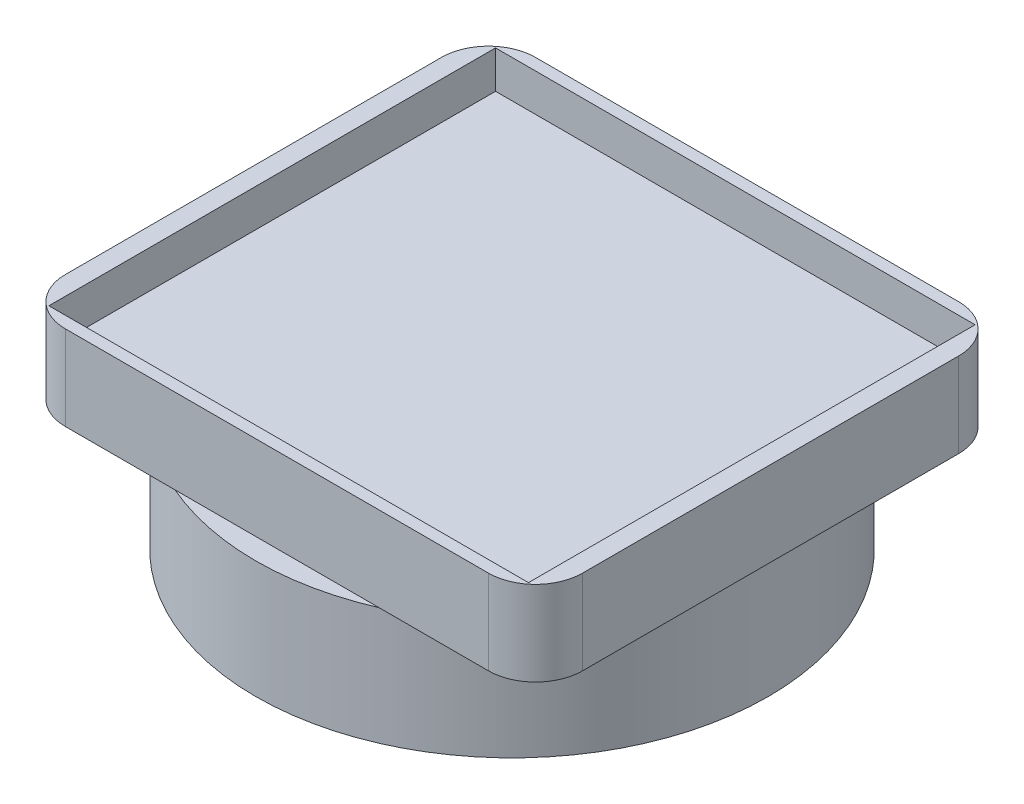
ISO-10303-21;
HEADER;
FILE_DESCRIPTION(('STEP AP214'),'2;1');
FILE_NAME('part.step','',(''),(''),'','','');
FILE_SCHEMA(('AUTOMOTIVE_DESIGN { 1 0 10303 214 1 1 1 1 }'));
ENDSEC;
DATA;
#1=APPLICATION_CONTEXT('core data for automotive mechanical design processes');
#2=APPLICATION_PROTOCOL_DEFINITION('international standard','automotive_design',2000,#1);
#3=PRODUCT_CONTEXT('',#1,'mechanical');
#4=PRODUCT('Part','Part','',(#3));
#5=PRODUCT_RELATED_PRODUCT_CATEGORY('part','',(#4));
#6=PRODUCT_DEFINITION_FORMATION('','',#4);
#7=PRODUCT_DEFINITION_CONTEXT('part definition',#1,'design');
#8=PRODUCT_DEFINITION('design','',#6,#7);
#9=PRODUCT_DEFINITION_SHAPE('','',#8);
#10=(LENGTH_UNIT() NAMED_UNIT(*) SI_UNIT(.MILLI.,.METRE.));
#11=(NAMED_UNIT(*) PLANE_ANGLE_UNIT() SI_UNIT($,.RADIAN.));
#12=(NAMED_UNIT(*) SI_UNIT($,.STERADIAN.) SOLID_ANGLE_UNIT());
#13=UNCERTAINTY_MEASURE_WITH_UNIT(LENGTH_MEASURE(1.E-05),#10,'distance_accuracy_value','');
#14=(GEOMETRIC_REPRESENTATION_CONTEXT(3) GLOBAL_UNCERTAINTY_ASSIGNED_CONTEXT((#13)) GLOBAL_UNIT_ASSIGNED_CONTEXT((#10,
#11,#12)) REPRESENTATION_CONTEXT('',''));
#15=CARTESIAN_POINT('',(0.,0.,0.));
#16=DIRECTION('',(0.,0.,1.));
#17=DIRECTION('',(1.,0.,0.));
#18=AXIS2_PLACEMENT_3D('',#15,#16,#17);
#19=CARTESIAN_POINT('',(0.,-2.54,0.));
#20=DIRECTION('',(0.,-1.,0.));
#21=DIRECTION('',(0.,0.,-1.));
#22=AXIS2_PLACEMENT_3D('',#19,#20,#21);
#23=PLANE('',#22);
#24=DIRECTION('',(0.,0.,-1.));
#25=VECTOR('',#24,1.);
#26=CARTESIAN_POINT('',(13.97,-2.54,-12.7));
#27=LINE('',#26,#25);
#28=CARTESIAN_POINT('',(13.97,-2.54,10.16));
#29=VERTEX_POINT('',#28);
#30=CARTESIAN_POINT('',(13.97,-2.54,-10.16));
#31=VERTEX_POINT('',#30);
#32=EDGE_CURVE('E163',#29,#31,#27,.T.);
#33=ORIENTED_EDGE('',*,*,#32,.F.);
#34=CARTESIAN_POINT('',(11.43,-2.54,10.16));
#35=DIRECTION('',(0.,-1.,0.));
#36=DIRECTION('',(0.,0.,-1.));
#37=AXIS2_PLACEMENT_3D('',#34,#35,#36);
#38=CIRCLE('',#37,2.54);
#39=CARTESIAN_POINT('',(11.43,-2.54,12.7));
#40=VERTEX_POINT('',#39);
#41=EDGE_CURVE('E11',#29,#40,#38,.T.);
#42=ORIENTED_EDGE('',*,*,#41,.T.);
#43=DIRECTION('',(1.,0.,0.));
#44=VECTOR('',#43,1.);
#45=CARTESIAN_POINT('',(13.97,-2.54,12.7));
#46=LINE('',#45,#44);
#47=CARTESIAN_POINT('',(5.50805310431917,-2.54,12.7));
#48=VERTEX_POINT('',#47);
#49=EDGE_CURVE('E196',#48,#40,#46,.T.);
#50=ORIENTED_EDGE('',*,*,#49,.F.);
#51=CARTESIAN_POINT('',(0.,-2.54,0.));
#52=DIRECTION('',(0.,-1.,0.));
#53=DIRECTION('',(0.,0.,-1.));
#54=AXIS2_PLACEMENT_3D('',#51,#52,#53);
#55=CIRCLE('',#54,13.843);
#56=CARTESIAN_POINT('',(5.50805310431917,-2.54,-12.7));
#57=VERTEX_POINT('',#56);
#58=EDGE_CURVE('E171',#57,#48,#55,.T.);
#59=ORIENTED_EDGE('',*,*,#58,.F.);
#60=DIRECTION('',(-1.,0.,0.));
#61=VECTOR('',#60,1.);
#62=CARTESIAN_POINT('',(13.97,-2.54,-12.7));
#63=LINE('',#62,#61);
#64=CARTESIAN_POINT('',(11.43,-2.54,-12.7));
#65=VERTEX_POINT('',#64);
#66=EDGE_CURVE('E146',#65,#57,#63,.T.);
#67=ORIENTED_EDGE('',*,*,#66,.F.);
#68=CARTESIAN_POINT('',(11.43,-2.54,-10.16));
#69=DIRECTION('',(0.,-1.,0.));
#70=DIRECTION('',(0.,0.,-1.));
#71=AXIS2_PLACEMENT_3D('',#68,#69,#70);
#72=CIRCLE('',#71,2.54);
#73=EDGE_CURVE('E48',#65,#31,#72,.T.);
#74=ORIENTED_EDGE('',*,*,#73,.T.);
#75=EDGE_LOOP('',(#33,#42,#50,#59,#67,#74));
#76=FACE_BOUND('',#75,.T.);
#77=ADVANCED_FACE('F39',(#76),#23,.T.);
#78=CARTESIAN_POINT('',(0.,2.032,0.));
#79=DIRECTION('',(0.,1.,0.));
#80=DIRECTION('',(0.,0.,1.));
#81=AXIS2_PLACEMENT_3D('',#78,#79,#80);
#82=PLANE('',#81);
#83=DIRECTION('',(-1.,0.,0.));
#84=VECTOR('',#83,1.);
#85=CARTESIAN_POINT('',(-13.97,2.032,-12.7));
#86=LINE('',#85,#84);
#87=CARTESIAN_POINT('',(11.43,2.032,-12.7));
#88=VERTEX_POINT('',#87);
#89=CARTESIAN_POINT('',(-11.43,2.032,-12.7));
#90=VERTEX_POINT('',#89);
#91=EDGE_CURVE('E253',#88,#90,#86,.T.);
#92=ORIENTED_EDGE('',*,*,#91,.T.);
#93=CARTESIAN_POINT('',(-11.43,2.032,-10.16));
#94=DIRECTION('',(0.,1.,0.));
#95=DIRECTION('',(0.,0.,1.));
#96=AXIS2_PLACEMENT_3D('',#93,#94,#95);
#97=CIRCLE('',#96,2.54);
#98=CARTESIAN_POINT('',(-13.97,2.032,-10.16));
#99=VERTEX_POINT('',#98);
#100=EDGE_CURVE('E287',#90,#99,#97,.T.);
#101=ORIENTED_EDGE('',*,*,#100,.T.);
#102=DIRECTION('',(0.,0.,1.));
#103=VECTOR('',#102,1.);
#104=CARTESIAN_POINT('',(-13.97,2.032,-12.7));
#105=LINE('',#104,#103);
#106=CARTESIAN_POINT('',(-13.97,2.032,10.16));
#107=VERTEX_POINT('',#106);
#108=EDGE_CURVE('E183',#99,#107,#105,.T.);
#109=ORIENTED_EDGE('',*,*,#108,.T.);
#110=CARTESIAN_POINT('',(-11.43,2.032,10.16));
#111=DIRECTION('',(0.,1.,0.));
#112=DIRECTION('',(0.,0.,1.));
#113=AXIS2_PLACEMENT_3D('',#110,#111,#112);
#114=CIRCLE('',#113,2.54);
#115=CARTESIAN_POINT('',(-11.43,2.032,12.7));
#116=VERTEX_POINT('',#115);
#117=EDGE_CURVE('E284',#107,#116,#114,.T.);
#118=ORIENTED_EDGE('',*,*,#117,.T.);
#119=DIRECTION('',(1.,0.,0.));
#120=VECTOR('',#119,1.);
#121=CARTESIAN_POINT('',(-13.97,2.032,12.7));
#122=LINE('',#121,#120);
#123=CARTESIAN_POINT('',(11.43,2.032,12.7));
#124=VERTEX_POINT('',#123);
#125=EDGE_CURVE('E177',#116,#124,#122,.T.);
#126=ORIENTED_EDGE('',*,*,#125,.T.);
#127=CARTESIAN_POINT('',(11.43,2.032,10.16));
#128=DIRECTION('',(0.,1.,0.));
#129=DIRECTION('',(0.,0.,1.));
#130=AXIS2_PLACEMENT_3D('',#127,#128,#129);
#131=CIRCLE('',#130,2.54);
#132=CARTESIAN_POINT('',(13.97,2.032,10.16));
#133=VERTEX_POINT('',#132);
#134=EDGE_CURVE('E281',#124,#133,#131,.T.);
#135=ORIENTED_EDGE('',*,*,#134,.T.);
#136=DIRECTION('',(0.,0.,-1.));
#137=VECTOR('',#136,1.);
#138=CARTESIAN_POINT('',(13.97,2.032,-12.7));
#139=LINE('',#138,#137);
#140=CARTESIAN_POINT('',(13.97,2.032,-10.16));
#141=VERTEX_POINT('',#140);
#142=EDGE_CURVE('E249',#133,#141,#139,.T.);
#143=ORIENTED_EDGE('',*,*,#142,.T.);
#144=CARTESIAN_POINT('',(11.43,2.032,-10.16));
#145=DIRECTION('',(0.,1.,0.));
#146=DIRECTION('',(0.,0.,1.));
#147=AXIS2_PLACEMENT_3D('',#144,#145,#146);
#148=CIRCLE('',#147,2.54);
#149=EDGE_CURVE('E278',#141,#88,#148,.T.);
#150=ORIENTED_EDGE('',*,*,#149,.T.);
#151=EDGE_LOOP('',(#92,#101,#109,#118,#126,#135,#143,#150));
#152=FACE_BOUND('',#151,.T.);
#153=DIRECTION('',(-1.,0.,0.));
#154=VECTOR('',#153,1.);
#155=CARTESIAN_POINT('',(-12.954,2.032,-12.065));
#156=LINE('',#155,#154);
#157=CARTESIAN_POINT('',(12.954,2.032,-12.065));
#158=VERTEX_POINT('',#157);
#159=CARTESIAN_POINT('',(-12.954,2.032,-12.065));
#160=VERTEX_POINT('',#159);
#161=EDGE_CURVE('E226',#158,#160,#156,.T.);
#162=ORIENTED_EDGE('',*,*,#161,.F.);
#163=DIRECTION('',(0.,0.,-1.));
#164=VECTOR('',#163,1.);
#165=CARTESIAN_POINT('',(12.954,2.032,-12.065));
#166=LINE('',#165,#164);
#167=CARTESIAN_POINT('',(12.954,2.032,12.065));
#168=VERTEX_POINT('',#167);
#169=EDGE_CURVE('E223',#168,#158,#166,.T.);
#170=ORIENTED_EDGE('',*,*,#169,.F.);
#171=DIRECTION('',(1.,0.,0.));
#172=VECTOR('',#171,1.);
#173=CARTESIAN_POINT('',(-12.954,2.032,12.065));
#174=LINE('',#173,#172);
#175=CARTESIAN_POINT('',(-12.954,2.032,12.065));
#176=VERTEX_POINT('',#175);
#177=EDGE_CURVE('E233',#176,#168,#174,.T.);
#178=ORIENTED_EDGE('',*,*,#177,.F.);
#179=DIRECTION('',(0.,0.,1.));
#180=VECTOR('',#179,1.);
#181=CARTESIAN_POINT('',(-12.954,2.032,-12.065));
#182=LINE('',#181,#180);
#183=EDGE_CURVE('E229',#160,#176,#182,.T.);
#184=ORIENTED_EDGE('',*,*,#183,.F.);
#185=EDGE_LOOP('',(#162,#170,#178,#184));
#186=FACE_BOUND('',#185,.T.);
#187=ADVANCED_FACE('F312',(#152,#186),#82,.T.);
#188=CARTESIAN_POINT('',(13.97,2.032,-12.7));
#189=DIRECTION('',(-1.,0.,0.));
#190=DIRECTION('',(0.,0.,1.));
#191=AXIS2_PLACEMENT_3D('',#188,#189,#190);
#192=PLANE('',#191);
#193=ORIENTED_EDGE('',*,*,#142,.F.);
#194=DIRECTION('',(0.,-1.,0.));
#195=VECTOR('',#194,1.);
#196=CARTESIAN_POINT('',(13.97,2.032,10.16));
#197=LINE('',#196,#195);
#198=EDGE_CURVE('E300',#133,#29,#197,.T.);
#199=ORIENTED_EDGE('',*,*,#198,.T.);
#200=ORIENTED_EDGE('',*,*,#32,.T.);
#201=DIRECTION('',(0.,-1.,0.));
#202=VECTOR('',#201,1.);
#203=CARTESIAN_POINT('',(13.97,2.032,-10.16));
#204=LINE('',#203,#202);
#205=EDGE_CURVE('E297',#31,#141,#204,.F.);
#206=ORIENTED_EDGE('',*,*,#205,.T.);
#207=EDGE_LOOP('',(#193,#199,#200,#206));
#208=FACE_BOUND('',#207,.T.);
#209=ADVANCED_FACE('F305',(#208),#192,.F.);
#210=CARTESIAN_POINT('',(-13.97,2.032,-12.7));
#211=DIRECTION('',(0.,0.,1.));
#212=DIRECTION('',(1.,0.,0.));
#213=AXIS2_PLACEMENT_3D('',#210,#211,#212);
#214=PLANE('',#213);
#215=CARTESIAN_POINT('',(-5.50805310431917,-2.54,-12.7));
#216=VERTEX_POINT('',#215);
#217=CARTESIAN_POINT('',(-11.43,-2.54,-12.7));
#218=VERTEX_POINT('',#217);
#219=EDGE_CURVE('E143',#216,#218,#63,.T.);
#220=ORIENTED_EDGE('',*,*,#219,.T.);
#221=DIRECTION('',(0.,-1.,0.));
#222=VECTOR('',#221,1.);
#223=CARTESIAN_POINT('',(-11.43,2.032,-12.7));
#224=LINE('',#223,#222);
#225=EDGE_CURVE('E275',#218,#90,#224,.F.);
#226=ORIENTED_EDGE('',*,*,#225,.T.);
#227=ORIENTED_EDGE('',*,*,#91,.F.);
#228=DIRECTION('',(0.,-1.,0.));
#229=VECTOR('',#228,1.);
#230=CARTESIAN_POINT('',(11.43,2.032,-12.7));
#231=LINE('',#230,#229);
#232=EDGE_CURVE('E272',#88,#65,#231,.T.);
#233=ORIENTED_EDGE('',*,*,#232,.T.);
#234=ORIENTED_EDGE('',*,*,#66,.T.);
#235=EDGE_CURVE('E140',#57,#216,#63,.T.);
#236=ORIENTED_EDGE('',*,*,#235,.T.);
#237=EDGE_LOOP('',(#220,#226,#227,#233,#234,#236));
#238=FACE_BOUND('',#237,.T.);
#239=ADVANCED_FACE('F142',(#238),#214,.F.);
#240=CARTESIAN_POINT('',(-13.97,2.032,-12.7));
#241=DIRECTION('',(1.,0.,0.));
#242=DIRECTION('',(0.,0.,-1.));
#243=AXIS2_PLACEMENT_3D('',#240,#241,#242);
#244=PLANE('',#243);
#245=ORIENTED_EDGE('',*,*,#108,.F.);
#246=DIRECTION('',(0.,-1.,0.));
#247=VECTOR('',#246,1.);
#248=CARTESIAN_POINT('',(-13.97,2.032,-10.16));
#249=LINE('',#248,#247);
#250=CARTESIAN_POINT('',(-13.97,-2.54,-10.16));
#251=VERTEX_POINT('',#250);
#252=EDGE_CURVE('E180',#99,#251,#249,.T.);
#253=ORIENTED_EDGE('',*,*,#252,.T.);
#254=DIRECTION('',(0.,0.,1.));
#255=VECTOR('',#254,1.);
#256=CARTESIAN_POINT('',(-13.97,-2.54,-12.7));
#257=LINE('',#256,#255);
#258=CARTESIAN_POINT('',(-13.97,-2.54,10.16));
#259=VERTEX_POINT('',#258);
#260=EDGE_CURVE('E193',#251,#259,#257,.T.);
#261=ORIENTED_EDGE('',*,*,#260,.T.);
#262=DIRECTION('',(0.,-1.,0.));
#263=VECTOR('',#262,1.);
#264=CARTESIAN_POINT('',(-13.97,2.032,10.16));
#265=LINE('',#264,#263);
#266=EDGE_CURVE('E176',#259,#107,#265,.F.);
#267=ORIENTED_EDGE('',*,*,#266,.T.);
#268=EDGE_LOOP('',(#245,#253,#261,#267));
#269=FACE_BOUND('',#268,.T.);
#270=ADVANCED_FACE('F320',(#269),#244,.F.);
#271=CARTESIAN_POINT('',(-13.97,2.032,12.7));
#272=DIRECTION('',(0.,0.,-1.));
#273=DIRECTION('',(-1.,0.,0.));
#274=AXIS2_PLACEMENT_3D('',#271,#272,#273);
#275=PLANE('',#274);
#276=ORIENTED_EDGE('',*,*,#125,.F.);
#277=DIRECTION('',(0.,-1.,0.));
#278=VECTOR('',#277,1.);
#279=CARTESIAN_POINT('',(-11.43,2.032,12.7));
#280=LINE('',#279,#278);
#281=CARTESIAN_POINT('',(-11.43,-2.54,12.7));
#282=VERTEX_POINT('',#281);
#283=EDGE_CURVE('E293',#116,#282,#280,.T.);
#284=ORIENTED_EDGE('',*,*,#283,.T.);
#285=CARTESIAN_POINT('',(-5.50805310431917,-2.54,12.7));
#286=VERTEX_POINT('',#285);
#287=EDGE_CURVE('E201',#282,#286,#46,.T.);
#288=ORIENTED_EDGE('',*,*,#287,.T.);
#289=EDGE_CURVE('E199',#286,#48,#46,.T.);
#290=ORIENTED_EDGE('',*,*,#289,.T.);
#291=ORIENTED_EDGE('',*,*,#49,.T.);
#292=DIRECTION('',(0.,-1.,0.));
#293=VECTOR('',#292,1.);
#294=CARTESIAN_POINT('',(11.43,2.032,12.7));
#295=LINE('',#294,#293);
#296=EDGE_CURVE('E290',#40,#124,#295,.F.);
#297=ORIENTED_EDGE('',*,*,#296,.T.);
#298=EDGE_LOOP('',(#276,#284,#288,#290,#291,#297));
#299=FACE_BOUND('',#298,.T.);
#300=ADVANCED_FACE('F310',(#299),#275,.F.);
#301=CARTESIAN_POINT('',(12.954,2.032,-12.065));
#302=DIRECTION('',(-1.,0.,0.));
#303=DIRECTION('',(0.,0.,1.));
#304=AXIS2_PLACEMENT_3D('',#301,#302,#303);
#305=PLANE('',#304);
#306=DIRECTION('',(0.,0.,-1.));
#307=VECTOR('',#306,1.);
#308=CARTESIAN_POINT('',(12.954,0.,-12.065));
#309=LINE('',#308,#307);
#310=CARTESIAN_POINT('',(12.954,0.,12.065));
#311=VERTEX_POINT('',#310);
#312=CARTESIAN_POINT('',(12.954,0.,-12.065));
#313=VERTEX_POINT('',#312);
#314=EDGE_CURVE('E208',#311,#313,#309,.T.);
#315=ORIENTED_EDGE('',*,*,#314,.F.);
#316=DIRECTION('',(0.,-1.,0.));
#317=VECTOR('',#316,1.);
#318=CARTESIAN_POINT('',(12.954,2.032,12.065));
#319=LINE('',#318,#317);
#320=EDGE_CURVE('E236',#168,#311,#319,.T.);
#321=ORIENTED_EDGE('',*,*,#320,.F.);
#322=ORIENTED_EDGE('',*,*,#169,.T.);
#323=DIRECTION('',(0.,-1.,0.));
#324=VECTOR('',#323,1.);
#325=CARTESIAN_POINT('',(12.954,2.032,-12.065));
#326=LINE('',#325,#324);
#327=EDGE_CURVE('E245',#158,#313,#326,.T.);
#328=ORIENTED_EDGE('',*,*,#327,.T.);
#329=EDGE_LOOP('',(#315,#321,#322,#328));
#330=FACE_BOUND('',#329,.T.);
#331=ADVANCED_FACE('F363',(#330),#305,.T.);
#332=CARTESIAN_POINT('',(-12.954,2.032,-12.065));
#333=DIRECTION('',(0.,0.,1.));
#334=DIRECTION('',(1.,0.,0.));
#335=AXIS2_PLACEMENT_3D('',#332,#333,#334);
#336=PLANE('',#335);
#337=DIRECTION('',(-1.,0.,0.));
#338=VECTOR('',#337,1.);
#339=CARTESIAN_POINT('',(-12.954,0.,-12.065));
#340=LINE('',#339,#338);
#341=CARTESIAN_POINT('',(-12.954,0.,-12.065));
#342=VERTEX_POINT('',#341);
#343=EDGE_CURVE('E211',#313,#342,#340,.T.);
#344=ORIENTED_EDGE('',*,*,#343,.F.);
#345=ORIENTED_EDGE('',*,*,#327,.F.);
#346=ORIENTED_EDGE('',*,*,#161,.T.);
#347=DIRECTION('',(0.,-1.,0.));
#348=VECTOR('',#347,1.);
#349=CARTESIAN_POINT('',(-12.954,2.032,-12.065));
#350=LINE('',#349,#348);
#351=EDGE_CURVE('E242',#160,#342,#350,.T.);
#352=ORIENTED_EDGE('',*,*,#351,.T.);
#353=EDGE_LOOP('',(#344,#345,#346,#352));
#354=FACE_BOUND('',#353,.T.);
#355=ADVANCED_FACE('F359',(#354),#336,.T.);
#356=CARTESIAN_POINT('',(-12.954,2.032,-12.065));
#357=DIRECTION('',(1.,0.,0.));
#358=DIRECTION('',(0.,0.,-1.));
#359=AXIS2_PLACEMENT_3D('',#356,#357,#358);
#360=PLANE('',#359);
#361=DIRECTION('',(0.,0.,1.));
#362=VECTOR('',#361,1.);
#363=CARTESIAN_POINT('',(-12.954,0.,-12.065));
#364=LINE('',#363,#362);
#365=CARTESIAN_POINT('',(-12.954,0.,12.065));
#366=VERTEX_POINT('',#365);
#367=EDGE_CURVE('E215',#342,#366,#364,.T.);
#368=ORIENTED_EDGE('',*,*,#367,.F.);
#369=ORIENTED_EDGE('',*,*,#351,.F.);
#370=ORIENTED_EDGE('',*,*,#183,.T.);
#371=DIRECTION('',(0.,-1.,0.));
#372=VECTOR('',#371,1.);
#373=CARTESIAN_POINT('',(-12.954,2.032,12.065));
#374=LINE('',#373,#372);
#375=EDGE_CURVE('E239',#176,#366,#374,.T.);
#376=ORIENTED_EDGE('',*,*,#375,.T.);
#377=EDGE_LOOP('',(#368,#369,#370,#376));
#378=FACE_BOUND('',#377,.T.);
#379=ADVANCED_FACE('F353',(#378),#360,.T.);
#380=CARTESIAN_POINT('',(-12.954,2.032,12.065));
#381=DIRECTION('',(0.,0.,-1.));
#382=DIRECTION('',(-1.,0.,0.));
#383=AXIS2_PLACEMENT_3D('',#380,#381,#382);
#384=PLANE('',#383);
#385=DIRECTION('',(1.,0.,0.));
#386=VECTOR('',#385,1.);
#387=CARTESIAN_POINT('',(-12.954,0.,12.065));
#388=LINE('',#387,#386);
#389=EDGE_CURVE('E219',#366,#311,#388,.T.);
#390=ORIENTED_EDGE('',*,*,#389,.F.);
#391=ORIENTED_EDGE('',*,*,#375,.F.);
#392=ORIENTED_EDGE('',*,*,#177,.T.);
#393=ORIENTED_EDGE('',*,*,#320,.T.);
#394=EDGE_LOOP('',(#390,#391,#392,#393));
#395=FACE_BOUND('',#394,.T.);
#396=ADVANCED_FACE('F348',(#395),#384,.T.);
#397=CARTESIAN_POINT('',(0.,0.,0.));
#398=DIRECTION('',(0.,-1.,0.));
#399=DIRECTION('',(0.,0.,-1.));
#400=AXIS2_PLACEMENT_3D('',#397,#398,#399);
#401=PLANE('',#400);
#402=ORIENTED_EDGE('',*,*,#389,.T.);
#403=ORIENTED_EDGE('',*,*,#314,.T.);
#404=ORIENTED_EDGE('',*,*,#343,.T.);
#405=ORIENTED_EDGE('',*,*,#367,.T.);
#406=EDGE_LOOP('',(#402,#403,#404,#405));
#407=FACE_BOUND('',#406,.T.);
#408=ADVANCED_FACE('F341',(#407),#401,.F.);
#409=ORIENTED_EDGE('',*,*,#260,.F.);
#410=CARTESIAN_POINT('',(-11.43,-2.54,-10.16));
#411=DIRECTION('',(0.,-1.,0.));
#412=DIRECTION('',(0.,0.,-1.));
#413=AXIS2_PLACEMENT_3D('',#410,#411,#412);
#414=CIRCLE('',#413,2.54);
#415=EDGE_CURVE('E161',#251,#218,#414,.T.);
#416=ORIENTED_EDGE('',*,*,#415,.T.);
#417=ORIENTED_EDGE('',*,*,#219,.F.);
#418=EDGE_CURVE('E159',#286,#216,#55,.T.);
#419=ORIENTED_EDGE('',*,*,#418,.F.);
#420=ORIENTED_EDGE('',*,*,#287,.F.);
#421=CARTESIAN_POINT('',(-11.43,-2.54,10.16));
#422=DIRECTION('',(0.,-1.,0.));
#423=DIRECTION('',(0.,0.,-1.));
#424=AXIS2_PLACEMENT_3D('',#421,#422,#423);
#425=CIRCLE('',#424,2.54);
#426=EDGE_CURVE('E267',#282,#259,#425,.T.);
#427=ORIENTED_EDGE('',*,*,#426,.T.);
#428=EDGE_LOOP('',(#409,#416,#417,#419,#420,#427));
#429=FACE_BOUND('',#428,.T.);
#430=ADVANCED_FACE('F156',(#429),#23,.T.);
#431=CARTESIAN_POINT('',(0.,-2.54,0.));
#432=DIRECTION('',(0.,-1.,0.));
#433=DIRECTION('',(0.,0.,-1.));
#434=AXIS2_PLACEMENT_3D('',#431,#432,#433);
#435=PLANE('',#434);
#436=ORIENTED_EDGE('',*,*,#235,.F.);
#437=EDGE_CURVE('E164',#216,#57,#55,.T.);
#438=ORIENTED_EDGE('',*,*,#437,.F.);
#439=EDGE_LOOP('',(#436,#438));
#440=FACE_BOUND('',#439,.T.);
#441=ADVANCED_FACE('F165',(#440),#435,.F.);
#442=CARTESIAN_POINT('',(0.,-8.89,0.));
#443=DIRECTION('',(0.,1.,0.));
#444=DIRECTION('',(0.,0.,1.));
#445=AXIS2_PLACEMENT_3D('',#442,#443,#444);
#446=CYLINDRICAL_SURFACE('',#445,13.843);
#447=CARTESIAN_POINT('',(0.,-8.89,0.));
#448=DIRECTION('',(0.,-1.,0.));
#449=DIRECTION('',(0.,0.,-1.));
#450=AXIS2_PLACEMENT_3D('',#447,#448,#449);
#451=CIRCLE('',#450,13.843);
#452=CARTESIAN_POINT('',(0.,-8.89,-13.843));
#453=VERTEX_POINT('',#452);
#454=EDGE_CURVE('E188',#453,#453,#451,.T.);
#455=ORIENTED_EDGE('',*,*,#454,.F.);
#456=EDGE_LOOP('',(#455));
#457=FACE_BOUND('',#456,.T.);
#458=ORIENTED_EDGE('',*,*,#58,.T.);
#459=EDGE_CURVE('E169',#48,#286,#55,.T.);
#460=ORIENTED_EDGE('',*,*,#459,.T.);
#461=ORIENTED_EDGE('',*,*,#418,.T.);
#462=ORIENTED_EDGE('',*,*,#437,.T.);
#463=EDGE_LOOP('',(#458,#460,#461,#462));
#464=FACE_BOUND('',#463,.T.);
#465=ADVANCED_FACE('F173',(#457,#464),#446,.T.);
#466=CARTESIAN_POINT('',(0.,-8.89,0.));
#467=DIRECTION('',(0.,-1.,0.));
#468=DIRECTION('',(0.,0.,-1.));
#469=AXIS2_PLACEMENT_3D('',#466,#467,#468);
#470=PLANE('',#469);
#471=ORIENTED_EDGE('',*,*,#454,.T.);
#472=EDGE_LOOP('',(#471));
#473=FACE_BOUND('',#472,.T.);
#474=ADVANCED_FACE('F407',(#473),#470,.T.);
#475=ORIENTED_EDGE('',*,*,#289,.F.);
#476=ORIENTED_EDGE('',*,*,#459,.F.);
#477=EDGE_LOOP('',(#475,#476));
#478=FACE_BOUND('',#477,.T.);
#479=ADVANCED_FACE('F347',(#478),#435,.F.);
#480=CARTESIAN_POINT('',(-11.43,2.032,-10.16));
#481=DIRECTION('',(0.,-1.,0.));
#482=DIRECTION('',(0.,0.,-1.));
#483=AXIS2_PLACEMENT_3D('',#480,#481,#482);
#484=CYLINDRICAL_SURFACE('',#483,2.54);
#485=ORIENTED_EDGE('',*,*,#100,.F.);
#486=ORIENTED_EDGE('',*,*,#225,.F.);
#487=ORIENTED_EDGE('',*,*,#415,.F.);
#488=ORIENTED_EDGE('',*,*,#252,.F.);
#489=EDGE_LOOP('',(#485,#486,#487,#488));
#490=FACE_BOUND('',#489,.T.);
#491=ADVANCED_FACE('F324',(#490),#484,.T.);
#492=CARTESIAN_POINT('',(-11.43,2.032,10.16));
#493=DIRECTION('',(0.,-1.,0.));
#494=DIRECTION('',(0.,0.,-1.));
#495=AXIS2_PLACEMENT_3D('',#492,#493,#494);
#496=CYLINDRICAL_SURFACE('',#495,2.54);
#497=ORIENTED_EDGE('',*,*,#117,.F.);
#498=ORIENTED_EDGE('',*,*,#266,.F.);
#499=ORIENTED_EDGE('',*,*,#426,.F.);
#500=ORIENTED_EDGE('',*,*,#283,.F.);
#501=EDGE_LOOP('',(#497,#498,#499,#500));
#502=FACE_BOUND('',#501,.T.);
#503=ADVANCED_FACE('F317',(#502),#496,.T.);
#504=CARTESIAN_POINT('',(11.43,2.032,10.16));
#505=DIRECTION('',(0.,-1.,0.));
#506=DIRECTION('',(0.,0.,-1.));
#507=AXIS2_PLACEMENT_3D('',#504,#505,#506);
#508=CYLINDRICAL_SURFACE('',#507,2.54);
#509=ORIENTED_EDGE('',*,*,#134,.F.);
#510=ORIENTED_EDGE('',*,*,#296,.F.);
#511=ORIENTED_EDGE('',*,*,#41,.F.);
#512=ORIENTED_EDGE('',*,*,#198,.F.);
#513=EDGE_LOOP('',(#509,#510,#511,#512));
#514=FACE_BOUND('',#513,.T.);
#515=ADVANCED_FACE('F311',(#514),#508,.T.);
#516=CARTESIAN_POINT('',(11.43,2.032,-10.16));
#517=DIRECTION('',(0.,-1.,0.));
#518=DIRECTION('',(0.,0.,-1.));
#519=AXIS2_PLACEMENT_3D('',#516,#517,#518);
#520=CYLINDRICAL_SURFACE('',#519,2.54);
#521=ORIENTED_EDGE('',*,*,#149,.F.);
#522=ORIENTED_EDGE('',*,*,#205,.F.);
#523=ORIENTED_EDGE('',*,*,#73,.F.);
#524=ORIENTED_EDGE('',*,*,#232,.F.);
#525=EDGE_LOOP('',(#521,#522,#523,#524));
#526=FACE_BOUND('',#525,.T.);
#527=ADVANCED_FACE('F41',(#526),#520,.T.);
#528=CLOSED_SHELL('',(#77,#187,#209,#239,#270,#300,#331,#355,#379,#396,#408,#430,#441,#465,#474,
#479,#491,#503,#515,#527));
#529=MANIFOLD_SOLID_BREP('B2',#528);
#530=ADVANCED_BREP_SHAPE_REPRESENTATION('',(#18,#529),#14);
#531=SHAPE_DEFINITION_REPRESENTATION(#9,#530);
ENDSEC;
END-ISO-10303-21;
